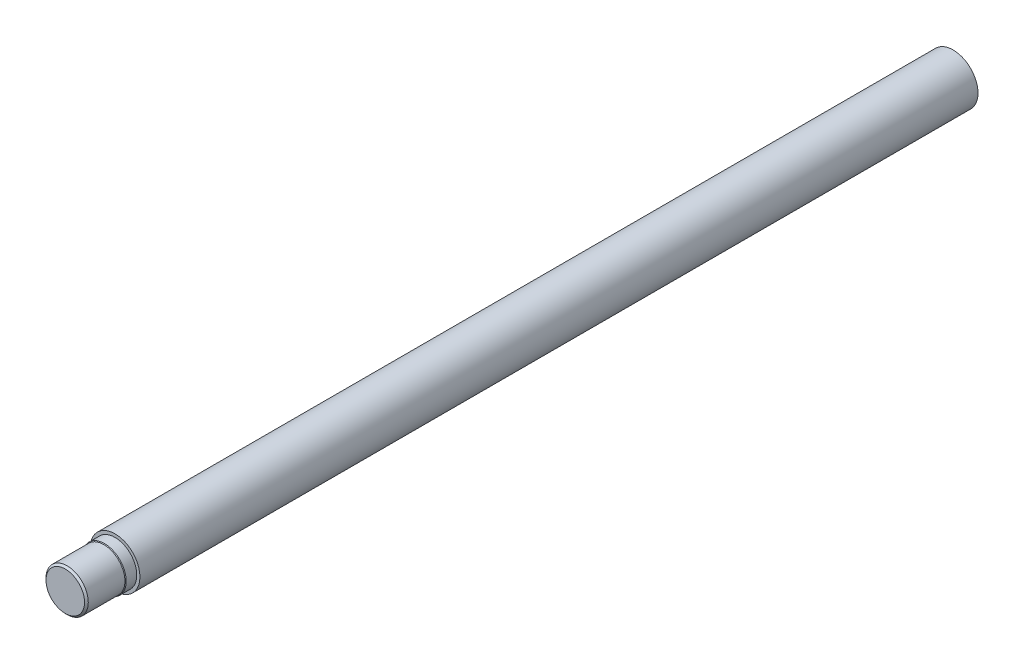
ISO-10303-21;
HEADER;
FILE_DESCRIPTION(('STEP AP214'),'2;1');
FILE_NAME('part.step','',(''),(''),'','','');
FILE_SCHEMA(('AUTOMOTIVE_DESIGN { 1 0 10303 214 1 1 1 1 }'));
ENDSEC;
DATA;
#1=APPLICATION_CONTEXT('core data for automotive mechanical design processes');
#2=APPLICATION_PROTOCOL_DEFINITION('international standard','automotive_design',2000,#1);
#3=PRODUCT_CONTEXT('',#1,'mechanical');
#4=PRODUCT('Part','Part','',(#3));
#5=PRODUCT_RELATED_PRODUCT_CATEGORY('part','',(#4));
#6=PRODUCT_DEFINITION_FORMATION('','',#4);
#7=PRODUCT_DEFINITION_CONTEXT('part definition',#1,'design');
#8=PRODUCT_DEFINITION('design','',#6,#7);
#9=PRODUCT_DEFINITION_SHAPE('','',#8);
#10=(LENGTH_UNIT() NAMED_UNIT(*) SI_UNIT(.MILLI.,.METRE.));
#11=(NAMED_UNIT(*) PLANE_ANGLE_UNIT() SI_UNIT($,.RADIAN.));
#12=(NAMED_UNIT(*) SI_UNIT($,.STERADIAN.) SOLID_ANGLE_UNIT());
#13=UNCERTAINTY_MEASURE_WITH_UNIT(LENGTH_MEASURE(1.E-05),#10,'distance_accuracy_value','');
#14=(GEOMETRIC_REPRESENTATION_CONTEXT(3) GLOBAL_UNCERTAINTY_ASSIGNED_CONTEXT((#13)) GLOBAL_UNIT_ASSIGNED_CONTEXT((#10,
#11,#12)) REPRESENTATION_CONTEXT('',''));
#15=CARTESIAN_POINT('',(0.,0.,0.));
#16=DIRECTION('',(0.,0.,1.));
#17=DIRECTION('',(1.,0.,0.));
#18=AXIS2_PLACEMENT_3D('',#15,#16,#17);
#19=CARTESIAN_POINT('',(0.,0.,714.));
#20=DIRECTION('',(0.,0.,-1.));
#21=DIRECTION('',(-1.,0.,0.));
#22=AXIS2_PLACEMENT_3D('',#19,#20,#21);
#23=CYLINDRICAL_SURFACE('',#22,40.);
#24=CARTESIAN_POINT('',(0.,0.,634.));
#25=DIRECTION('',(0.,0.,-1.));
#26=DIRECTION('',(-1.,0.,0.));
#27=AXIS2_PLACEMENT_3D('',#24,#25,#26);
#28=CIRCLE('',#27,40.);
#29=CARTESIAN_POINT('',(-40.,0.,634.));
#30=VERTEX_POINT('',#29);
#31=EDGE_CURVE('E57',#30,#30,#28,.T.);
#32=ORIENTED_EDGE('',*,*,#31,.T.);
#33=EDGE_LOOP('',(#32));
#34=FACE_BOUND('',#33,.T.);
#35=CARTESIAN_POINT('',(0.,0.,-714.));
#36=DIRECTION('',(0.,0.,1.));
#37=DIRECTION('',(1.,0.,0.));
#38=AXIS2_PLACEMENT_3D('',#35,#36,#37);
#39=CIRCLE('',#38,40.);
#40=CARTESIAN_POINT('',(40.,0.,-714.));
#41=VERTEX_POINT('',#40);
#42=EDGE_CURVE('E56',#41,#41,#39,.T.);
#43=ORIENTED_EDGE('',*,*,#42,.T.);
#44=EDGE_LOOP('',(#43));
#45=FACE_BOUND('',#44,.T.);
#46=ADVANCED_FACE('F36',(#34,#45),#23,.T.);
#47=CARTESIAN_POINT('',(0.,0.,-714.));
#48=DIRECTION('',(0.,0.,1.));
#49=DIRECTION('',(1.,0.,0.));
#50=AXIS2_PLACEMENT_3D('',#47,#48,#49);
#51=PLANE('',#50);
#52=ORIENTED_EDGE('',*,*,#42,.F.);
#53=EDGE_LOOP('',(#52));
#54=FACE_BOUND('',#53,.T.);
#55=ADVANCED_FACE('F84',(#54),#51,.F.);
#56=CARTESIAN_POINT('',(0.,34.9999999999999,634.));
#57=DIRECTION('',(0.,0.,-1.));
#58=DIRECTION('',(-1.,0.,0.));
#59=AXIS2_PLACEMENT_3D('',#56,#57,#58);
#60=PLANE('',#59);
#61=CARTESIAN_POINT('',(0.,0.,634.));
#62=DIRECTION('',(0.,0.,-1.));
#63=DIRECTION('',(-1.,0.,0.));
#64=AXIS2_PLACEMENT_3D('',#61,#62,#63);
#65=CIRCLE('',#64,34.9999999999999);
#66=CARTESIAN_POINT('',(-34.9999999999999,0.,634.));
#67=VERTEX_POINT('',#66);
#68=EDGE_CURVE('E60',#67,#67,#65,.T.);
#69=ORIENTED_EDGE('',*,*,#68,.T.);
#70=EDGE_LOOP('',(#69));
#71=FACE_BOUND('',#70,.T.);
#72=ORIENTED_EDGE('',*,*,#31,.F.);
#73=EDGE_LOOP('',(#72));
#74=FACE_BOUND('',#73,.T.);
#75=ADVANCED_FACE('F66',(#71,#74),#60,.F.);
#76=CARTESIAN_POINT('',(0.,0.,0.));
#77=DIRECTION('',(0.,0.,-1.));
#78=DIRECTION('',(-1.,0.,0.));
#79=AXIS2_PLACEMENT_3D('',#76,#77,#78);
#80=CYLINDRICAL_SURFACE('',#79,33.9999999999999);
#81=CARTESIAN_POINT('',(0.,0.,652.));
#82=DIRECTION('',(0.,0.,-1.));
#83=DIRECTION('',(-1.,0.,0.));
#84=AXIS2_PLACEMENT_3D('',#81,#82,#83);
#85=CIRCLE('',#84,33.9999999999999);
#86=CARTESIAN_POINT('',(-33.9999999999999,0.,652.));
#87=VERTEX_POINT('',#86);
#88=EDGE_CURVE('E10',#87,#87,#85,.F.);
#89=ORIENTED_EDGE('',*,*,#88,.T.);
#90=EDGE_LOOP('',(#89));
#91=FACE_BOUND('',#90,.T.);
#92=CARTESIAN_POINT('',(0.,0.,711.));
#93=DIRECTION('',(0.,0.,1.));
#94=DIRECTION('',(1.,0.,0.));
#95=AXIS2_PLACEMENT_3D('',#92,#93,#94);
#96=CIRCLE('',#95,33.9999999999999);
#97=CARTESIAN_POINT('',(33.9999999999999,0.,711.));
#98=VERTEX_POINT('',#97);
#99=EDGE_CURVE('E47',#98,#98,#96,.F.);
#100=ORIENTED_EDGE('',*,*,#99,.T.);
#101=EDGE_LOOP('',(#100));
#102=FACE_BOUND('',#101,.T.);
#103=ADVANCED_FACE('F72',(#91,#102),#80,.T.);
#104=CARTESIAN_POINT('',(0.,0.,0.));
#105=DIRECTION('',(0.,0.,-1.));
#106=DIRECTION('',(-1.,0.,0.));
#107=AXIS2_PLACEMENT_3D('',#104,#105,#106);
#108=CYLINDRICAL_SURFACE('',#107,34.9999999999999);
#109=CARTESIAN_POINT('',(0.,0.,651.));
#110=DIRECTION('',(0.,0.,-1.));
#111=DIRECTION('',(-1.,0.,0.));
#112=AXIS2_PLACEMENT_3D('',#109,#110,#111);
#113=CIRCLE('',#112,34.9999999999999);
#114=CARTESIAN_POINT('',(-34.9999999999999,0.,651.));
#115=VERTEX_POINT('',#114);
#116=EDGE_CURVE('E51',#115,#115,#113,.T.);
#117=ORIENTED_EDGE('',*,*,#116,.T.);
#118=EDGE_LOOP('',(#117));
#119=FACE_BOUND('',#118,.T.);
#120=ORIENTED_EDGE('',*,*,#68,.F.);
#121=EDGE_LOOP('',(#120));
#122=FACE_BOUND('',#121,.T.);
#123=ADVANCED_FACE('F69',(#119,#122),#108,.T.);
#124=CARTESIAN_POINT('',(0.,0.,714.));
#125=DIRECTION('',(0.,0.,1.));
#126=DIRECTION('',(1.,0.,0.));
#127=AXIS2_PLACEMENT_3D('',#124,#125,#126);
#128=PLANE('',#127);
#129=CARTESIAN_POINT('',(0.,0.,714.));
#130=DIRECTION('',(0.,0.,1.));
#131=DIRECTION('',(1.,0.,0.));
#132=AXIS2_PLACEMENT_3D('',#129,#130,#131);
#133=CIRCLE('',#132,30.9999999999999);
#134=CARTESIAN_POINT('',(30.9999999999999,0.,714.));
#135=VERTEX_POINT('',#134);
#136=EDGE_CURVE('E43',#135,#135,#133,.T.);
#137=ORIENTED_EDGE('',*,*,#136,.T.);
#138=EDGE_LOOP('',(#137));
#139=FACE_BOUND('',#138,.T.);
#140=ADVANCED_FACE('F71',(#139),#128,.T.);
#141=CARTESIAN_POINT('',(0.,0.,651.));
#142=DIRECTION('',(0.,0.,-1.));
#143=DIRECTION('',(-1.,0.,0.));
#144=AXIS2_PLACEMENT_3D('',#141,#142,#143);
#145=CONICAL_SURFACE('',#144,34.9999999999999,0.785398163397452);
#146=ORIENTED_EDGE('',*,*,#88,.F.);
#147=EDGE_LOOP('',(#146));
#148=FACE_BOUND('',#147,.T.);
#149=ORIENTED_EDGE('',*,*,#116,.F.);
#150=EDGE_LOOP('',(#149));
#151=FACE_BOUND('',#150,.T.);
#152=ADVANCED_FACE('F79',(#148,#151),#145,.T.);
#153=CARTESIAN_POINT('',(0.,0.,711.));
#154=DIRECTION('',(0.,0.,-1.));
#155=DIRECTION('',(-1.,0.,0.));
#156=AXIS2_PLACEMENT_3D('',#153,#154,#155);
#157=CONICAL_SURFACE('',#156,33.9999999999999,0.785398163397446);
#158=ORIENTED_EDGE('',*,*,#136,.F.);
#159=EDGE_LOOP('',(#158));
#160=FACE_BOUND('',#159,.T.);
#161=ORIENTED_EDGE('',*,*,#99,.F.);
#162=EDGE_LOOP('',(#161));
#163=FACE_BOUND('',#162,.T.);
#164=ADVANCED_FACE('F38',(#160,#163),#157,.T.);
#165=CLOSED_SHELL('',(#46,#55,#75,#103,#123,#140,#152,#164));
#166=MANIFOLD_SOLID_BREP('B2',#165);
#167=ADVANCED_BREP_SHAPE_REPRESENTATION('',(#18,#166),#14);
#168=SHAPE_DEFINITION_REPRESENTATION(#9,#167);
ENDSEC;
END-ISO-10303-21;
